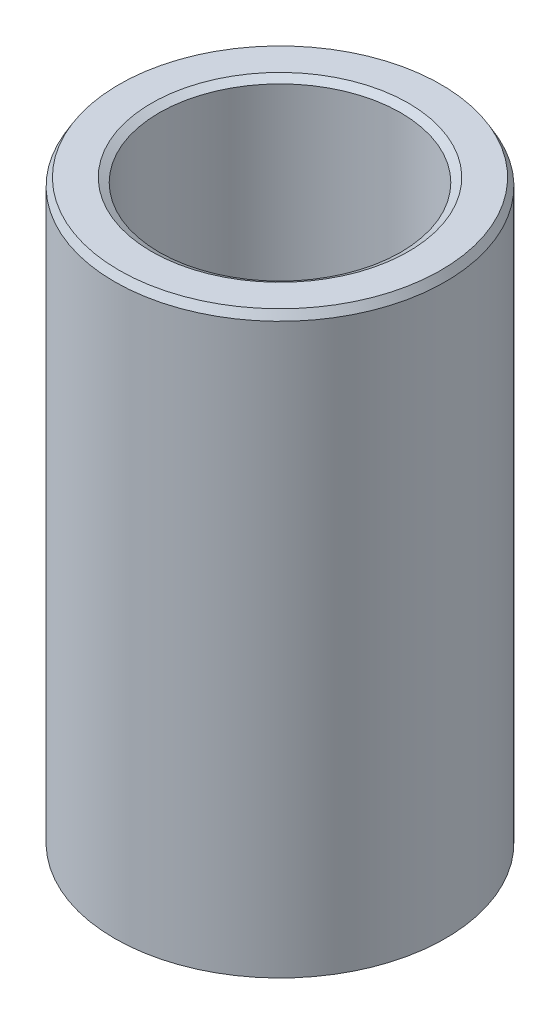
ISO-10303-21;
HEADER;
FILE_DESCRIPTION(('STEP AP214'),'2;1');
FILE_NAME('part.step','',(''),(''),'','','');
FILE_SCHEMA(('AUTOMOTIVE_DESIGN { 1 0 10303 214 1 1 1 1 }'));
ENDSEC;
DATA;
#1=APPLICATION_CONTEXT('core data for automotive mechanical design processes');
#2=APPLICATION_PROTOCOL_DEFINITION('international standard','automotive_design',2000,#1);
#3=PRODUCT_CONTEXT('',#1,'mechanical');
#4=PRODUCT('Part','Part','',(#3));
#5=PRODUCT_RELATED_PRODUCT_CATEGORY('part','',(#4));
#6=PRODUCT_DEFINITION_FORMATION('','',#4);
#7=PRODUCT_DEFINITION_CONTEXT('part definition',#1,'design');
#8=PRODUCT_DEFINITION('design','',#6,#7);
#9=PRODUCT_DEFINITION_SHAPE('','',#8);
#10=(LENGTH_UNIT() NAMED_UNIT(*) SI_UNIT(.MILLI.,.METRE.));
#11=(NAMED_UNIT(*) PLANE_ANGLE_UNIT() SI_UNIT($,.RADIAN.));
#12=(NAMED_UNIT(*) SI_UNIT($,.STERADIAN.) SOLID_ANGLE_UNIT());
#13=UNCERTAINTY_MEASURE_WITH_UNIT(LENGTH_MEASURE(1.E-05),#10,'distance_accuracy_value','');
#14=(GEOMETRIC_REPRESENTATION_CONTEXT(3) GLOBAL_UNCERTAINTY_ASSIGNED_CONTEXT((#13)) GLOBAL_UNIT_ASSIGNED_CONTEXT((#10,
#11,#12)) REPRESENTATION_CONTEXT('',''));
#15=CARTESIAN_POINT('',(0.,0.,0.));
#16=DIRECTION('',(0.,0.,1.));
#17=DIRECTION('',(1.,0.,0.));
#18=AXIS2_PLACEMENT_3D('',#15,#16,#17);
#19=CARTESIAN_POINT('',(0.,70.2380678084444,0.));
#20=DIRECTION('',(0.,-1.,0.));
#21=DIRECTION('',(0.,0.,-1.));
#22=AXIS2_PLACEMENT_3D('',#19,#20,#21);
#23=CYLINDRICAL_SURFACE('',#22,20.);
#24=CARTESIAN_POINT('',(0.,0.539758299475362,0.));
#25=DIRECTION('',(0.,1.,0.));
#26=DIRECTION('',(0.,0.,1.));
#27=AXIS2_PLACEMENT_3D('',#24,#25,#26);
#28=CIRCLE('',#27,20.);
#29=CARTESIAN_POINT('',(0.,0.539758299475362,20.));
#30=VERTEX_POINT('',#29);
#31=EDGE_CURVE('E10',#30,#30,#28,.T.);
#32=ORIENTED_EDGE('',*,*,#31,.T.);
#33=EDGE_LOOP('',(#32));
#34=FACE_BOUND('',#33,.T.);
#35=CARTESIAN_POINT('',(0.,69.303179009946,0.));
#36=DIRECTION('',(0.,1.,0.));
#37=DIRECTION('',(0.,0.,1.));
#38=AXIS2_PLACEMENT_3D('',#35,#36,#37);
#39=CIRCLE('',#38,20.);
#40=CARTESIAN_POINT('',(0.,69.303179009946,20.));
#41=VERTEX_POINT('',#40);
#42=EDGE_CURVE('E50',#41,#41,#39,.F.);
#43=ORIENTED_EDGE('',*,*,#42,.T.);
#44=EDGE_LOOP('',(#43));
#45=FACE_BOUND('',#44,.T.);
#46=ADVANCED_FACE('F39',(#34,#45),#23,.T.);
#47=CARTESIAN_POINT('',(0.,70.2380678084444,0.));
#48=DIRECTION('',(0.,1.,0.));
#49=DIRECTION('',(0.,0.,1.));
#50=AXIS2_PLACEMENT_3D('',#47,#48,#49);
#51=PLANE('',#50);
#52=CARTESIAN_POINT('',(0.,70.2380678084444,0.));
#53=DIRECTION('',(0.,1.,0.));
#54=DIRECTION('',(0.,0.,1.));
#55=AXIS2_PLACEMENT_3D('',#52,#53,#54);
#56=CIRCLE('',#55,15.5400466528826);
#57=CARTESIAN_POINT('',(0.,70.2380678084444,15.5400466528826));
#58=VERTEX_POINT('',#57);
#59=EDGE_CURVE('E58',#58,#58,#56,.F.);
#60=ORIENTED_EDGE('',*,*,#59,.T.);
#61=EDGE_LOOP('',(#60));
#62=FACE_BOUND('',#61,.T.);
#63=CARTESIAN_POINT('',(0.,70.2380678084444,0.));
#64=DIRECTION('',(0.,1.,0.));
#65=DIRECTION('',(0.,0.,1.));
#66=AXIS2_PLACEMENT_3D('',#63,#64,#65);
#67=CIRCLE('',#66,19.4602417005246);
#68=CARTESIAN_POINT('',(0.,70.2380678084444,19.4602417005246));
#69=VERTEX_POINT('',#68);
#70=EDGE_CURVE('E61',#69,#69,#67,.T.);
#71=ORIENTED_EDGE('',*,*,#70,.T.);
#72=EDGE_LOOP('',(#71));
#73=FACE_BOUND('',#72,.T.);
#74=ADVANCED_FACE('F88',(#62,#73),#51,.T.);
#75=CARTESIAN_POINT('',(0.,0.,0.));
#76=DIRECTION('',(0.,1.,0.));
#77=DIRECTION('',(0.,0.,1.));
#78=AXIS2_PLACEMENT_3D('',#75,#76,#77);
#79=PLANE('',#78);
#80=CARTESIAN_POINT('',(0.,0.,0.));
#81=DIRECTION('',(0.,1.,0.));
#82=DIRECTION('',(0.,0.,1.));
#83=AXIS2_PLACEMENT_3D('',#80,#81,#82);
#84=CIRCLE('',#83,15.1449161538596);
#85=CARTESIAN_POINT('',(0.,0.,-15.1449161538596));
#86=VERTEX_POINT('',#85);
#87=EDGE_CURVE('E51',#86,#86,#84,.T.);
#88=ORIENTED_EDGE('',*,*,#87,.T.);
#89=EDGE_LOOP('',(#88));
#90=FACE_BOUND('',#89,.T.);
#91=CARTESIAN_POINT('',(0.,0.,0.));
#92=DIRECTION('',(0.,1.,0.));
#93=DIRECTION('',(0.,0.,1.));
#94=AXIS2_PLACEMENT_3D('',#91,#92,#93);
#95=CIRCLE('',#94,19.0651112015017);
#96=CARTESIAN_POINT('',(0.,0.,19.0651112015017));
#97=VERTEX_POINT('',#96);
#98=EDGE_CURVE('E54',#97,#97,#95,.F.);
#99=ORIENTED_EDGE('',*,*,#98,.T.);
#100=EDGE_LOOP('',(#99));
#101=FACE_BOUND('',#100,.T.);
#102=ADVANCED_FACE('F83',(#90,#101),#79,.F.);
#103=CARTESIAN_POINT('',(0.,70.2380678084444,0.));
#104=DIRECTION('',(0.,-1.,0.));
#105=DIRECTION('',(0.,0.,-1.));
#106=AXIS2_PLACEMENT_3D('',#103,#104,#105);
#107=CYLINDRICAL_SURFACE('',#106,14.6051578543842);
#108=CARTESIAN_POINT('',(0.,69.698309508969,0.));
#109=DIRECTION('',(0.,1.,0.));
#110=DIRECTION('',(0.,0.,1.));
#111=AXIS2_PLACEMENT_3D('',#108,#109,#110);
#112=CIRCLE('',#111,14.6051578543842);
#113=CARTESIAN_POINT('',(0.,69.698309508969,14.6051578543842));
#114=VERTEX_POINT('',#113);
#115=EDGE_CURVE('E67',#114,#114,#112,.T.);
#116=ORIENTED_EDGE('',*,*,#115,.T.);
#117=EDGE_LOOP('',(#116));
#118=FACE_BOUND('',#117,.T.);
#119=CARTESIAN_POINT('',(0.,0.934888798498318,0.));
#120=DIRECTION('',(0.,1.,0.));
#121=DIRECTION('',(0.,0.,1.));
#122=AXIS2_PLACEMENT_3D('',#119,#120,#121);
#123=CIRCLE('',#122,14.6051578543842);
#124=CARTESIAN_POINT('',(0.,0.934888798498318,-14.6051578543842));
#125=VERTEX_POINT('',#124);
#126=EDGE_CURVE('E69',#125,#125,#123,.F.);
#127=ORIENTED_EDGE('',*,*,#126,.T.);
#128=EDGE_LOOP('',(#127));
#129=FACE_BOUND('',#128,.T.);
#130=ADVANCED_FACE('F71',(#118,#129),#107,.F.);
#131=CARTESIAN_POINT('',(0.,69.698309508969,0.));
#132=DIRECTION('',(0.,1.,0.));
#133=DIRECTION('',(0.,0.,1.));
#134=AXIS2_PLACEMENT_3D('',#131,#132,#133);
#135=CONICAL_SURFACE('',#134,14.6051578543842,1.04719755119659);
#136=ORIENTED_EDGE('',*,*,#59,.F.);
#137=EDGE_LOOP('',(#136));
#138=FACE_BOUND('',#137,.T.);
#139=ORIENTED_EDGE('',*,*,#115,.F.);
#140=EDGE_LOOP('',(#139));
#141=FACE_BOUND('',#140,.T.);
#142=ADVANCED_FACE('F77',(#138,#141),#135,.F.);
#143=CARTESIAN_POINT('',(0.,0.,0.));
#144=DIRECTION('',(0.,-1.,0.));
#145=DIRECTION('',(0.,0.,-1.));
#146=AXIS2_PLACEMENT_3D('',#143,#144,#145);
#147=CONICAL_SURFACE('',#146,15.1449161538596,0.523598775598293);
#148=CARTESIAN_POINT('',(0.,0.934888798498318,-14.6051578543842));
#149=CARTESIAN_POINT('',(0.,0.92515037351396,-14.6107803366704));
#150=CARTESIAN_POINT('',(0.,0.915411948529603,-14.6164028189566));
#151=CARTESIAN_POINT('',(0.,0.895935098560888,-14.627647783529));
#152=CARTESIAN_POINT('',(0.,0.88619667357653,-14.6332702658152));
#153=CARTESIAN_POINT('',(0.,0.866719823607815,-14.6445152303876));
#154=CARTESIAN_POINT('',(0.,0.856981398623458,-14.6501377126738));
#155=CARTESIAN_POINT('',(0.,0.837504548654743,-14.6613826772463));
#156=CARTESIAN_POINT('',(0.,0.827766123670385,-14.6670051595325));
#157=CARTESIAN_POINT('',(0.,0.808289273701671,-14.6782501241049));
#158=CARTESIAN_POINT('',(0.,0.798550848717313,-14.6838726063911));
#159=CARTESIAN_POINT('',(0.,0.779073998748598,-14.6951175709635));
#160=CARTESIAN_POINT('',(0.,0.76933557376424,-14.7007400532497));
#161=CARTESIAN_POINT('',(0.,0.749858723795526,-14.7119850178221));
#162=CARTESIAN_POINT('',(0.,0.740120298811168,-14.7176075001083));
#163=CARTESIAN_POINT('',(0.,0.720643448842453,-14.7288524646807));
#164=CARTESIAN_POINT('',(0.,0.710905023858096,-14.7344749469669));
#165=CARTESIAN_POINT('',(0.,0.691428173889381,-14.7457199115393));
#166=CARTESIAN_POINT('',(0.,0.681689748905023,-14.7513423938255));
#167=CARTESIAN_POINT('',(0.,0.662212898936308,-14.7625873583979));
#168=CARTESIAN_POINT('',(0.,0.652474473951951,-14.7682098406841));
#169=CARTESIAN_POINT('',(0.,0.632997623983236,-14.7794548052565));
#170=CARTESIAN_POINT('',(0.,0.623259198998879,-14.7850772875427));
#171=CARTESIAN_POINT('',(0.,0.603782349030164,-14.7963222521151));
#172=CARTESIAN_POINT('',(0.,0.594043924045806,-14.8019447344013));
#173=CARTESIAN_POINT('',(0.,0.574567074077091,-14.8131896989737));
#174=CARTESIAN_POINT('',(0.,0.564828649092734,-14.8188121812599));
#175=CARTESIAN_POINT('',(0.,0.545351799124019,-14.8300571458323));
#176=CARTESIAN_POINT('',(0.,0.535613374139661,-14.8356796281185));
#177=CARTESIAN_POINT('',(0.,0.516136524170946,-14.8469245926909));
#178=CARTESIAN_POINT('',(0.,0.506398099186589,-14.8525470749771));
#179=CARTESIAN_POINT('',(0.,0.486921249217874,-14.8637920395495));
#180=CARTESIAN_POINT('',(0.,0.477182824233516,-14.8694145218357));
#181=CARTESIAN_POINT('',(0.,0.457705974264801,-14.8806594864081));
#182=CARTESIAN_POINT('',(0.,0.447967549280444,-14.8862819686943));
#183=CARTESIAN_POINT('',(0.,0.428490699311729,-14.8975269332667));
#184=CARTESIAN_POINT('',(0.,0.418752274327371,-14.9031494155529));
#185=CARTESIAN_POINT('',(0.,0.399275424358656,-14.9143943801253));
#186=CARTESIAN_POINT('',(0.,0.389536999374299,-14.9200168624115));
#187=CARTESIAN_POINT('',(0.,0.370060149405584,-14.9312618269839));
#188=CARTESIAN_POINT('',(0.,0.360321724421227,-14.9368843092701));
#189=CARTESIAN_POINT('',(0.,0.340844874452511,-14.9481292738425));
#190=CARTESIAN_POINT('',(0.,0.331106449468154,-14.9537517561287));
#191=CARTESIAN_POINT('',(0.,0.311629599499439,-14.9649967207011));
#192=CARTESIAN_POINT('',(0.,0.301891174515082,-14.9706192029873));
#193=CARTESIAN_POINT('',(0.,0.282414324546367,-14.9818641675597));
#194=CARTESIAN_POINT('',(0.,0.272675899562009,-14.9874866498459));
#195=CARTESIAN_POINT('',(0.,0.253199049593294,-14.9987316144184));
#196=CARTESIAN_POINT('',(0.,0.243460624608937,-15.0043540967046));
#197=CARTESIAN_POINT('',(0.,0.223983774640222,-15.015599061277));
#198=CARTESIAN_POINT('',(0.,0.214245349655865,-15.0212215435632));
#199=CARTESIAN_POINT('',(0.,0.19476849968715,-15.0324665081356));
#200=CARTESIAN_POINT('',(0.,0.185030074702792,-15.0380889904218));
#201=CARTESIAN_POINT('',(0.,0.165553224734077,-15.0493339549942));
#202=CARTESIAN_POINT('',(0.,0.15581479974972,-15.0549564372804));
#203=CARTESIAN_POINT('',(0.,0.136337949781005,-15.0662014018528));
#204=CARTESIAN_POINT('',(0.,0.126599524796647,-15.071823884139));
#205=CARTESIAN_POINT('',(0.,0.107122674827932,-15.0830688487114));
#206=CARTESIAN_POINT('',(0.,0.0973842498435748,-15.0886913309976));
#207=CARTESIAN_POINT('',(0.,0.07790739987486,-15.09993629557));
#208=CARTESIAN_POINT('',(0.,0.0681689748905024,-15.1055587778562));
#209=CARTESIAN_POINT('',(0.,0.0486921249217873,-15.1168037424286));
#210=CARTESIAN_POINT('',(0.,0.0389536999374298,-15.1224262247148));
#211=CARTESIAN_POINT('',(0.,0.0194768499687148,-15.1336711892872));
#212=CARTESIAN_POINT('',(0.,0.0097384249843573,-15.1392936715734));
#213=CARTESIAN_POINT('',(0.,0.,-15.1449161538596));
#214=B_SPLINE_CURVE_WITH_KNOTS('',3,(#148,#149,#150,#151,#152,#153,#154,#155,#156,#157,#158,
#159,#160,#161,#162,#163,#164,#165,#166,#167,#168,#169,#170,#171,#172,#173,#174,#175,#176,#177,
#178,#179,#180,#181,#182,#183,#184,#185,#186,#187,#188,#189,#190,#191,#192,#193,#194,#195,#196,
#197,#198,#199,#200,#201,#202,#203,#204,#205,#206,#207,#208,#209,#210,#211,#212,#213),
.UNSPECIFIED.,.F.,.F.,(4,2,2,2,2,2,2,2,2,2,2,2,2,2,2,2,2,2,2,2,2,2,2,2,2,2,2,2,2,2,2,2,4),(0.,
0.0337348937172109,0.067469787434421,0.101204681151631,0.134939574868842,0.168674468586053,
0.202409362303263,0.236144256020474,0.269879149737684,0.303614043454895,0.337348937172105,
0.371083830889316,0.404818724606526,0.438553618323737,0.472288512040947,0.506023405758157,
0.539758299475368,0.573493193192579,0.607228086909789,0.640962980627,0.67469787434421,
0.708432768061421,0.742167661778631,0.775902555495842,0.809637449213052,0.843372342930263,
0.877107236647473,0.910842130364684,0.944577024081894,0.978311917799104,1.01204681151631,
1.04578170523352,1.07951659895074),.UNSPECIFIED.);
#215=EDGE_CURVE('BSEAM73',#125,#86,#214,.T.);
#216=ORIENTED_EDGE('',*,*,#126,.F.);
#217=ORIENTED_EDGE('',*,*,#87,.F.);
#218=ORIENTED_EDGE('',*,*,#215,.T.);
#219=ORIENTED_EDGE('',*,*,#215,.F.);
#220=EDGE_LOOP('',(#216,#218,#217,#219));
#221=FACE_BOUND('',#220,.T.);
#222=ADVANCED_FACE('F73',(#221),#147,.F.);
#223=CARTESIAN_POINT('',(0.,0.539758299475362,0.));
#224=DIRECTION('',(0.,1.,0.));
#225=DIRECTION('',(0.,0.,1.));
#226=AXIS2_PLACEMENT_3D('',#223,#224,#225);
#227=CONICAL_SURFACE('',#226,20.,1.04719755119661);
#228=ORIENTED_EDGE('',*,*,#98,.F.);
#229=EDGE_LOOP('',(#228));
#230=FACE_BOUND('',#229,.T.);
#231=ORIENTED_EDGE('',*,*,#31,.F.);
#232=EDGE_LOOP('',(#231));
#233=FACE_BOUND('',#232,.T.);
#234=ADVANCED_FACE('F76',(#230,#233),#227,.T.);
#235=CARTESIAN_POINT('',(0.,70.2380678084444,0.));
#236=DIRECTION('',(0.,-1.,0.));
#237=DIRECTION('',(0.,0.,-1.));
#238=AXIS2_PLACEMENT_3D('',#235,#236,#237);
#239=CONICAL_SURFACE('',#238,19.4602417005246,0.523598775598295);
#240=ORIENTED_EDGE('',*,*,#42,.F.);
#241=EDGE_LOOP('',(#240));
#242=FACE_BOUND('',#241,.T.);
#243=ORIENTED_EDGE('',*,*,#70,.F.);
#244=EDGE_LOOP('',(#243));
#245=FACE_BOUND('',#244,.T.);
#246=ADVANCED_FACE('F45',(#242,#245),#239,.T.);
#247=CLOSED_SHELL('',(#46,#74,#102,#130,#142,#222,#234,#246));
#248=MANIFOLD_SOLID_BREP('B2',#247);
#249=ADVANCED_BREP_SHAPE_REPRESENTATION('',(#18,#248),#14);
#250=SHAPE_DEFINITION_REPRESENTATION(#9,#249);
ENDSEC;
END-ISO-10303-21;
